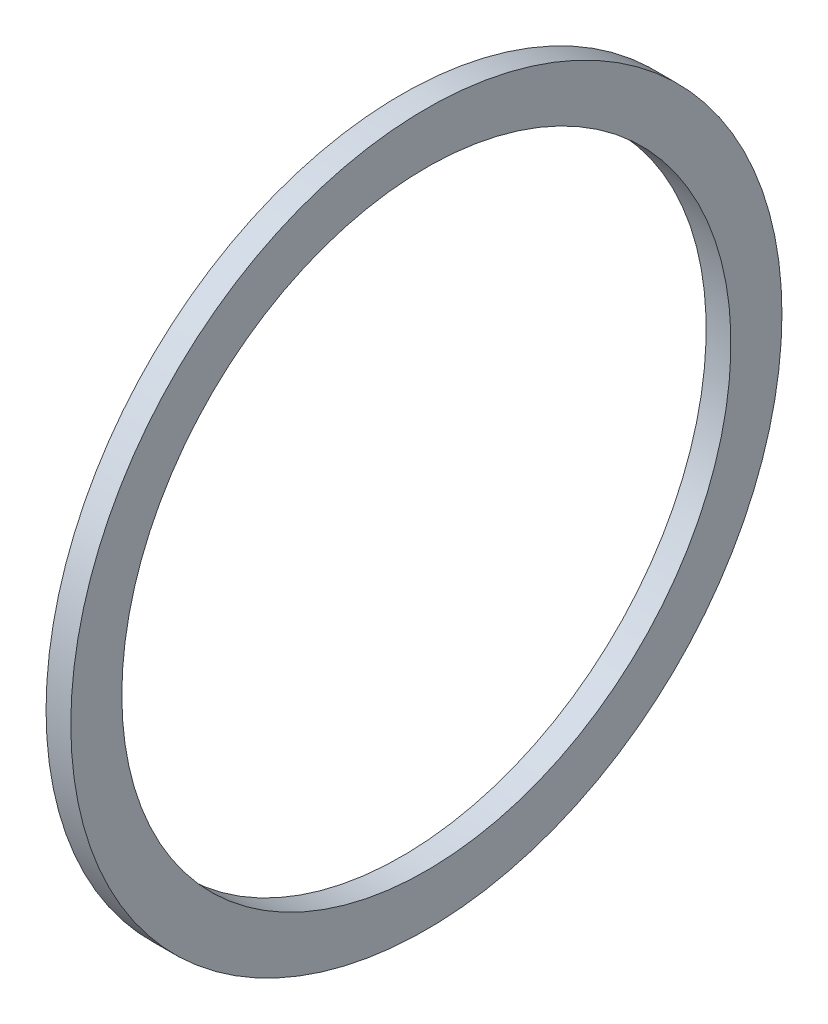
ISO-10303-21;
HEADER;
FILE_DESCRIPTION(('STEP AP214'),'2;1');
FILE_NAME('part.step','',(''),(''),'','','');
FILE_SCHEMA(('AUTOMOTIVE_DESIGN { 1 0 10303 214 1 1 1 1 }'));
ENDSEC;
DATA;
#1=APPLICATION_CONTEXT('core data for automotive mechanical design processes');
#2=APPLICATION_PROTOCOL_DEFINITION('international standard','automotive_design',2000,#1);
#3=PRODUCT_CONTEXT('',#1,'mechanical');
#4=PRODUCT('Part','Part','',(#3));
#5=PRODUCT_RELATED_PRODUCT_CATEGORY('part','',(#4));
#6=PRODUCT_DEFINITION_FORMATION('','',#4);
#7=PRODUCT_DEFINITION_CONTEXT('part definition',#1,'design');
#8=PRODUCT_DEFINITION('design','',#6,#7);
#9=PRODUCT_DEFINITION_SHAPE('','',#8);
#10=(LENGTH_UNIT() NAMED_UNIT(*) SI_UNIT(.MILLI.,.METRE.));
#11=(NAMED_UNIT(*) PLANE_ANGLE_UNIT() SI_UNIT($,.RADIAN.));
#12=(NAMED_UNIT(*) SI_UNIT($,.STERADIAN.) SOLID_ANGLE_UNIT());
#13=UNCERTAINTY_MEASURE_WITH_UNIT(LENGTH_MEASURE(1.E-05),#10,'distance_accuracy_value','');
#14=(GEOMETRIC_REPRESENTATION_CONTEXT(3) GLOBAL_UNCERTAINTY_ASSIGNED_CONTEXT((#13)) GLOBAL_UNIT_ASSIGNED_CONTEXT((#10,
#11,#12)) REPRESENTATION_CONTEXT('',''));
#15=CARTESIAN_POINT('',(0.,0.,0.));
#16=DIRECTION('',(0.,0.,1.));
#17=DIRECTION('',(1.,0.,0.));
#18=AXIS2_PLACEMENT_3D('',#15,#16,#17);
#19=CARTESIAN_POINT('',(0.,-25.019,0.));
#20=DIRECTION('',(-1.,0.,0.));
#21=DIRECTION('',(0.,0.,1.));
#22=AXIS2_PLACEMENT_3D('',#19,#20,#21);
#23=PLANE('',#22);
#24=CARTESIAN_POINT('',(0.,0.,0.));
#25=DIRECTION('',(-1.,0.,0.));
#26=DIRECTION('',(0.,0.,1.));
#27=AXIS2_PLACEMENT_3D('',#24,#25,#26);
#28=CIRCLE('',#27,29.21);
#29=CARTESIAN_POINT('',(0.,0.,29.21));
#30=VERTEX_POINT('',#29);
#31=EDGE_CURVE('E10',#30,#30,#28,.T.);
#32=ORIENTED_EDGE('',*,*,#31,.T.);
#33=EDGE_LOOP('',(#32));
#34=FACE_BOUND('',#33,.T.);
#35=CARTESIAN_POINT('',(0.,0.,0.));
#36=DIRECTION('',(-1.,0.,0.));
#37=DIRECTION('',(0.,0.,1.));
#38=AXIS2_PLACEMENT_3D('',#35,#36,#37);
#39=CIRCLE('',#38,25.019);
#40=CARTESIAN_POINT('',(0.,0.,25.019));
#41=VERTEX_POINT('',#40);
#42=EDGE_CURVE('E43',#41,#41,#39,.T.);
#43=ORIENTED_EDGE('',*,*,#42,.F.);
#44=EDGE_LOOP('',(#43));
#45=FACE_BOUND('',#44,.T.);
#46=ADVANCED_FACE('F29',(#34,#45),#23,.T.);
#47=CARTESIAN_POINT('',(-43.7165807560137,0.,0.));
#48=DIRECTION('',(-1.,0.,0.));
#49=DIRECTION('',(0.,0.,1.));
#50=AXIS2_PLACEMENT_3D('',#47,#48,#49);
#51=CYLINDRICAL_SURFACE('',#50,29.21);
#52=CARTESIAN_POINT('',(2.032,0.,0.));
#53=DIRECTION('',(-1.,0.,0.));
#54=DIRECTION('',(0.,0.,1.));
#55=AXIS2_PLACEMENT_3D('',#52,#53,#54);
#56=CIRCLE('',#55,29.21);
#57=CARTESIAN_POINT('',(2.032,0.,29.21));
#58=VERTEX_POINT('',#57);
#59=EDGE_CURVE('E35',#58,#58,#56,.T.);
#60=ORIENTED_EDGE('',*,*,#59,.T.);
#61=EDGE_LOOP('',(#60));
#62=FACE_BOUND('',#61,.T.);
#63=ORIENTED_EDGE('',*,*,#31,.F.);
#64=EDGE_LOOP('',(#63));
#65=FACE_BOUND('',#64,.T.);
#66=ADVANCED_FACE('F53',(#62,#65),#51,.T.);
#67=CARTESIAN_POINT('',(2.032,-25.019,0.));
#68=DIRECTION('',(1.,0.,0.));
#69=DIRECTION('',(0.,0.,-1.));
#70=AXIS2_PLACEMENT_3D('',#67,#68,#69);
#71=PLANE('',#70);
#72=CARTESIAN_POINT('',(2.032,0.,0.));
#73=DIRECTION('',(-1.,0.,0.));
#74=DIRECTION('',(0.,0.,1.));
#75=AXIS2_PLACEMENT_3D('',#72,#73,#74);
#76=CIRCLE('',#75,25.019);
#77=CARTESIAN_POINT('',(2.032,0.,25.019));
#78=VERTEX_POINT('',#77);
#79=EDGE_CURVE('E39',#78,#78,#76,.T.);
#80=ORIENTED_EDGE('',*,*,#79,.T.);
#81=EDGE_LOOP('',(#80));
#82=FACE_BOUND('',#81,.T.);
#83=ORIENTED_EDGE('',*,*,#59,.F.);
#84=EDGE_LOOP('',(#83));
#85=FACE_BOUND('',#84,.T.);
#86=ADVANCED_FACE('F57',(#82,#85),#71,.T.);
#87=CARTESIAN_POINT('',(-43.7165807560137,0.,0.));
#88=DIRECTION('',(-1.,0.,0.));
#89=DIRECTION('',(0.,0.,1.));
#90=AXIS2_PLACEMENT_3D('',#87,#88,#89);
#91=CYLINDRICAL_SURFACE('',#90,25.019);
#92=ORIENTED_EDGE('',*,*,#42,.T.);
#93=EDGE_LOOP('',(#92));
#94=FACE_BOUND('',#93,.T.);
#95=ORIENTED_EDGE('',*,*,#79,.F.);
#96=EDGE_LOOP('',(#95));
#97=FACE_BOUND('',#96,.T.);
#98=ADVANCED_FACE('F49',(#94,#97),#91,.F.);
#99=CLOSED_SHELL('',(#46,#66,#86,#98));
#100=MANIFOLD_SOLID_BREP('B2',#99);
#101=ADVANCED_BREP_SHAPE_REPRESENTATION('',(#18,#100),#14);
#102=SHAPE_DEFINITION_REPRESENTATION(#9,#101);
ENDSEC;
END-ISO-10303-21;
